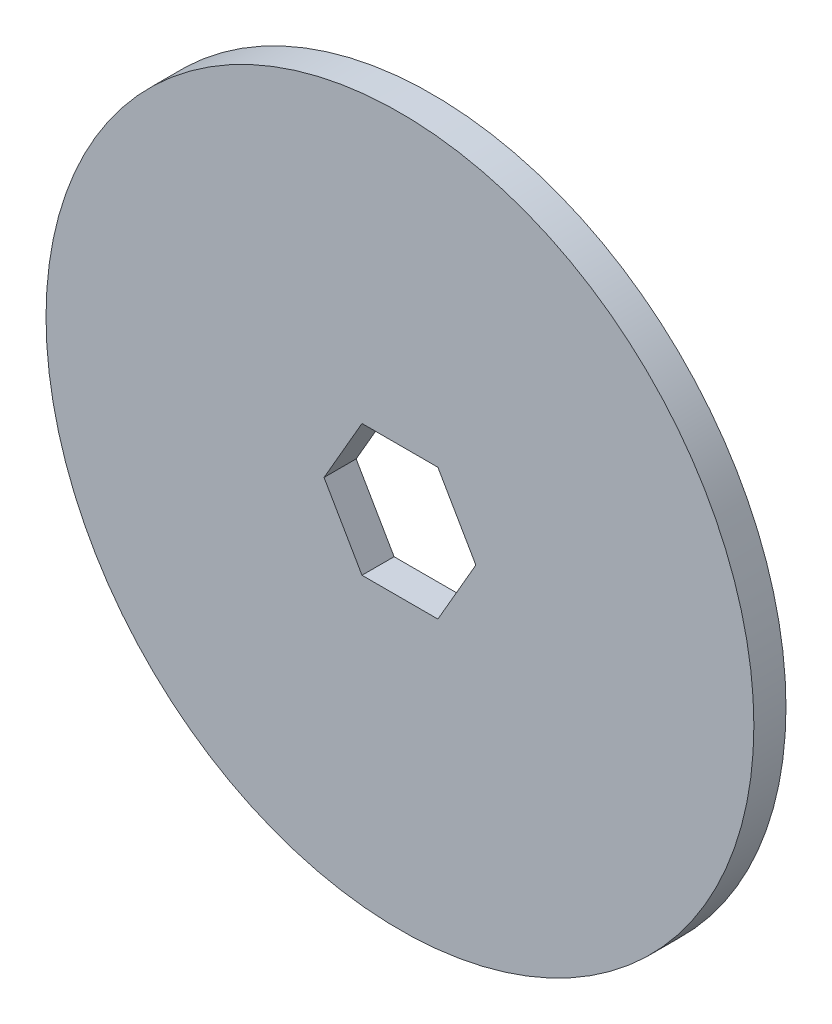
ISO-10303-21;
HEADER;
FILE_DESCRIPTION(('STEP AP214'),'2;1');
FILE_NAME('part.step','',(''),(''),'','','');
FILE_SCHEMA(('AUTOMOTIVE_DESIGN { 1 0 10303 214 1 1 1 1 }'));
ENDSEC;
DATA;
#1=APPLICATION_CONTEXT('core data for automotive mechanical design processes');
#2=APPLICATION_PROTOCOL_DEFINITION('international standard','automotive_design',2000,#1);
#3=PRODUCT_CONTEXT('',#1,'mechanical');
#4=PRODUCT('Part','Part','',(#3));
#5=PRODUCT_RELATED_PRODUCT_CATEGORY('part','',(#4));
#6=PRODUCT_DEFINITION_FORMATION('','',#4);
#7=PRODUCT_DEFINITION_CONTEXT('part definition',#1,'design');
#8=PRODUCT_DEFINITION('design','',#6,#7);
#9=PRODUCT_DEFINITION_SHAPE('','',#8);
#10=(LENGTH_UNIT() NAMED_UNIT(*) SI_UNIT(.MILLI.,.METRE.));
#11=(NAMED_UNIT(*) PLANE_ANGLE_UNIT() SI_UNIT($,.RADIAN.));
#12=(NAMED_UNIT(*) SI_UNIT($,.STERADIAN.) SOLID_ANGLE_UNIT());
#13=UNCERTAINTY_MEASURE_WITH_UNIT(LENGTH_MEASURE(1.E-05),#10,'distance_accuracy_value','');
#14=(GEOMETRIC_REPRESENTATION_CONTEXT(3) GLOBAL_UNCERTAINTY_ASSIGNED_CONTEXT((#13)) GLOBAL_UNIT_ASSIGNED_CONTEXT((#10,
#11,#12)) REPRESENTATION_CONTEXT('',''));
#15=CARTESIAN_POINT('',(0.,0.,0.));
#16=DIRECTION('',(0.,0.,1.));
#17=DIRECTION('',(1.,0.,0.));
#18=AXIS2_PLACEMENT_3D('',#15,#16,#17);
#19=CARTESIAN_POINT('',(0.,0.,3.175));
#20=DIRECTION('',(0.,0.,-1.));
#21=DIRECTION('',(-1.,0.,0.));
#22=AXIS2_PLACEMENT_3D('',#19,#20,#21);
#23=CYLINDRICAL_SURFACE('',#22,35.);
#24=CARTESIAN_POINT('',(0.,0.,3.175));
#25=DIRECTION('',(0.,0.,1.));
#26=DIRECTION('',(1.,0.,0.));
#27=AXIS2_PLACEMENT_3D('',#24,#25,#26);
#28=CIRCLE('',#27,35.);
#29=CARTESIAN_POINT('',(35.,0.,3.175));
#30=VERTEX_POINT('',#29);
#31=EDGE_CURVE('E11',#30,#30,#28,.T.);
#32=ORIENTED_EDGE('',*,*,#31,.F.);
#33=EDGE_LOOP('',(#32));
#34=FACE_BOUND('',#33,.T.);
#35=CARTESIAN_POINT('',(0.,0.,0.));
#36=DIRECTION('',(0.,0.,1.));
#37=DIRECTION('',(1.,0.,0.));
#38=AXIS2_PLACEMENT_3D('',#35,#36,#37);
#39=CIRCLE('',#38,35.);
#40=CARTESIAN_POINT('',(35.,0.,0.));
#41=VERTEX_POINT('',#40);
#42=EDGE_CURVE('E42',#41,#41,#39,.T.);
#43=ORIENTED_EDGE('',*,*,#42,.T.);
#44=EDGE_LOOP('',(#43));
#45=FACE_BOUND('',#44,.T.);
#46=ADVANCED_FACE('F39',(#34,#45),#23,.T.);
#47=CARTESIAN_POINT('',(0.,0.,3.175));
#48=DIRECTION('',(0.,0.,1.));
#49=DIRECTION('',(1.,0.,0.));
#50=AXIS2_PLACEMENT_3D('',#47,#48,#49);
#51=PLANE('',#50);
#52=DIRECTION('',(0.5,0.866025403784439,0.));
#53=VECTOR('',#52,1.);
#54=CARTESIAN_POINT('',(3.75277674973257,-6.5,3.175));
#55=LINE('',#54,#53);
#56=CARTESIAN_POINT('',(3.75277674973257,-6.5,3.175));
#57=VERTEX_POINT('',#56);
#58=CARTESIAN_POINT('',(7.50555349946513,0.,3.175));
#59=VERTEX_POINT('',#58);
#60=EDGE_CURVE('E53',#57,#59,#55,.T.);
#61=ORIENTED_EDGE('',*,*,#60,.F.);
#62=DIRECTION('',(1.,0.,0.));
#63=VECTOR('',#62,1.);
#64=CARTESIAN_POINT('',(-3.75277674973257,-6.5,3.175));
#65=LINE('',#64,#63);
#66=CARTESIAN_POINT('',(-3.75277674973257,-6.5,3.175));
#67=VERTEX_POINT('',#66);
#68=EDGE_CURVE('E99',#67,#57,#65,.T.);
#69=ORIENTED_EDGE('',*,*,#68,.F.);
#70=DIRECTION('',(0.5,-0.866025403784439,0.));
#71=VECTOR('',#70,1.);
#72=CARTESIAN_POINT('',(-7.50555349946514,0.,3.175));
#73=LINE('',#72,#71);
#74=CARTESIAN_POINT('',(-7.50555349946514,0.,3.175));
#75=VERTEX_POINT('',#74);
#76=EDGE_CURVE('E126',#75,#67,#73,.T.);
#77=ORIENTED_EDGE('',*,*,#76,.F.);
#78=DIRECTION('',(-0.5,-0.866025403784439,0.));
#79=VECTOR('',#78,1.);
#80=CARTESIAN_POINT('',(-3.75277674973257,6.5,3.175));
#81=LINE('',#80,#79);
#82=CARTESIAN_POINT('',(-3.75277674973257,6.5,3.175));
#83=VERTEX_POINT('',#82);
#84=EDGE_CURVE('E123',#83,#75,#81,.T.);
#85=ORIENTED_EDGE('',*,*,#84,.F.);
#86=DIRECTION('',(-1.,0.,0.));
#87=VECTOR('',#86,1.);
#88=CARTESIAN_POINT('',(3.75277674973257,6.5,3.175));
#89=LINE('',#88,#87);
#90=CARTESIAN_POINT('',(3.75277674973257,6.5,3.175));
#91=VERTEX_POINT('',#90);
#92=EDGE_CURVE('E120',#91,#83,#89,.T.);
#93=ORIENTED_EDGE('',*,*,#92,.F.);
#94=DIRECTION('',(-0.5,0.866025403784439,0.));
#95=VECTOR('',#94,1.);
#96=CARTESIAN_POINT('',(7.50555349946513,0.,3.175));
#97=LINE('',#96,#95);
#98=EDGE_CURVE('E113',#59,#91,#97,.T.);
#99=ORIENTED_EDGE('',*,*,#98,.F.);
#100=EDGE_LOOP('',(#61,#69,#77,#85,#93,#99));
#101=FACE_BOUND('',#100,.T.);
#102=ORIENTED_EDGE('',*,*,#31,.T.);
#103=EDGE_LOOP('',(#102));
#104=FACE_BOUND('',#103,.T.);
#105=ADVANCED_FACE('F142',(#101,#104),#51,.T.);
#106=CARTESIAN_POINT('',(0.,0.,0.));
#107=DIRECTION('',(0.,0.,1.));
#108=DIRECTION('',(1.,0.,0.));
#109=AXIS2_PLACEMENT_3D('',#106,#107,#108);
#110=PLANE('',#109);
#111=DIRECTION('',(-1.,0.,0.));
#112=VECTOR('',#111,1.);
#113=CARTESIAN_POINT('',(-3.75277674973257,-6.5,0.));
#114=LINE('',#113,#112);
#115=CARTESIAN_POINT('',(3.75277674973257,-6.5,0.));
#116=VERTEX_POINT('',#115);
#117=CARTESIAN_POINT('',(-3.75277674973257,-6.5,0.));
#118=VERTEX_POINT('',#117);
#119=EDGE_CURVE('E111',#116,#118,#114,.T.);
#120=ORIENTED_EDGE('',*,*,#119,.F.);
#121=DIRECTION('',(-0.5,-0.866025403784439,0.));
#122=VECTOR('',#121,1.);
#123=CARTESIAN_POINT('',(3.75277674973257,-6.5,0.));
#124=LINE('',#123,#122);
#125=CARTESIAN_POINT('',(7.50555349946513,0.,0.));
#126=VERTEX_POINT('',#125);
#127=EDGE_CURVE('E93',#126,#116,#124,.T.);
#128=ORIENTED_EDGE('',*,*,#127,.F.);
#129=DIRECTION('',(0.5,-0.866025403784439,0.));
#130=VECTOR('',#129,1.);
#131=CARTESIAN_POINT('',(7.50555349946513,0.,0.));
#132=LINE('',#131,#130);
#133=CARTESIAN_POINT('',(3.75277674973257,6.5,0.));
#134=VERTEX_POINT('',#133);
#135=EDGE_CURVE('E102',#134,#126,#132,.T.);
#136=ORIENTED_EDGE('',*,*,#135,.F.);
#137=DIRECTION('',(1.,0.,0.));
#138=VECTOR('',#137,1.);
#139=CARTESIAN_POINT('',(3.75277674973257,6.5,0.));
#140=LINE('',#139,#138);
#141=CARTESIAN_POINT('',(-3.75277674973257,6.5,0.));
#142=VERTEX_POINT('',#141);
#143=EDGE_CURVE('E61',#142,#134,#140,.T.);
#144=ORIENTED_EDGE('',*,*,#143,.F.);
#145=DIRECTION('',(0.5,0.866025403784439,0.));
#146=VECTOR('',#145,1.);
#147=CARTESIAN_POINT('',(-3.75277674973257,6.5,0.));
#148=LINE('',#147,#146);
#149=CARTESIAN_POINT('',(-7.50555349946514,0.,0.));
#150=VERTEX_POINT('',#149);
#151=EDGE_CURVE('E151',#150,#142,#148,.T.);
#152=ORIENTED_EDGE('',*,*,#151,.F.);
#153=DIRECTION('',(-0.5,0.866025403784439,0.));
#154=VECTOR('',#153,1.);
#155=CARTESIAN_POINT('',(-7.50555349946514,0.,0.));
#156=LINE('',#155,#154);
#157=EDGE_CURVE('E115',#118,#150,#156,.T.);
#158=ORIENTED_EDGE('',*,*,#157,.F.);
#159=EDGE_LOOP('',(#120,#128,#136,#144,#152,#158));
#160=FACE_BOUND('',#159,.T.);
#161=ORIENTED_EDGE('',*,*,#42,.F.);
#162=EDGE_LOOP('',(#161));
#163=FACE_BOUND('',#162,.T.);
#164=ADVANCED_FACE('F107',(#160,#163),#110,.F.);
#165=CARTESIAN_POINT('',(3.75277674973257,-6.5,-0.00100000000000013));
#166=DIRECTION('',(0.866025403784439,-0.5,0.));
#167=DIRECTION('',(0.5,0.866025403784439,0.));
#168=AXIS2_PLACEMENT_3D('',#165,#166,#167);
#169=PLANE('',#168);
#170=ORIENTED_EDGE('',*,*,#127,.T.);
#171=DIRECTION('',(0.,0.,1.));
#172=VECTOR('',#171,1.);
#173=CARTESIAN_POINT('',(3.75277674973257,-6.5,-0.00100000000000013));
#174=LINE('',#173,#172);
#175=EDGE_CURVE('E105',#116,#57,#174,.T.);
#176=ORIENTED_EDGE('',*,*,#175,.T.);
#177=ORIENTED_EDGE('',*,*,#60,.T.);
#178=DIRECTION('',(0.,0.,1.));
#179=VECTOR('',#178,1.);
#180=CARTESIAN_POINT('',(7.50555349946513,0.,-0.00100000000000013));
#181=LINE('',#180,#179);
#182=EDGE_CURVE('E89',#126,#59,#181,.T.);
#183=ORIENTED_EDGE('',*,*,#182,.F.);
#184=EDGE_LOOP('',(#170,#176,#177,#183));
#185=FACE_BOUND('',#184,.T.);
#186=ADVANCED_FACE('F91',(#185),#169,.F.);
#187=CARTESIAN_POINT('',(-3.75277674973257,-6.5,-0.00100000000000013));
#188=DIRECTION('',(0.,-1.,0.));
#189=DIRECTION('',(1.,0.,0.));
#190=AXIS2_PLACEMENT_3D('',#187,#188,#189);
#191=PLANE('',#190);
#192=ORIENTED_EDGE('',*,*,#119,.T.);
#193=DIRECTION('',(0.,0.,1.));
#194=VECTOR('',#193,1.);
#195=CARTESIAN_POINT('',(-3.75277674973257,-6.5,-0.00100000000000013));
#196=LINE('',#195,#194);
#197=EDGE_CURVE('E132',#118,#67,#196,.T.);
#198=ORIENTED_EDGE('',*,*,#197,.T.);
#199=ORIENTED_EDGE('',*,*,#68,.T.);
#200=ORIENTED_EDGE('',*,*,#175,.F.);
#201=EDGE_LOOP('',(#192,#198,#199,#200));
#202=FACE_BOUND('',#201,.T.);
#203=ADVANCED_FACE('F157',(#202),#191,.F.);
#204=CARTESIAN_POINT('',(-7.50555349946514,0.,-0.00100000000000013));
#205=DIRECTION('',(-0.866025403784439,-0.5,0.));
#206=DIRECTION('',(0.5,-0.866025403784439,0.));
#207=AXIS2_PLACEMENT_3D('',#204,#205,#206);
#208=PLANE('',#207);
#209=ORIENTED_EDGE('',*,*,#157,.T.);
#210=DIRECTION('',(0.,0.,1.));
#211=VECTOR('',#210,1.);
#212=CARTESIAN_POINT('',(-7.50555349946514,0.,-0.00100000000000013));
#213=LINE('',#212,#211);
#214=EDGE_CURVE('E134',#150,#75,#213,.T.);
#215=ORIENTED_EDGE('',*,*,#214,.T.);
#216=ORIENTED_EDGE('',*,*,#76,.T.);
#217=ORIENTED_EDGE('',*,*,#197,.F.);
#218=EDGE_LOOP('',(#209,#215,#216,#217));
#219=FACE_BOUND('',#218,.T.);
#220=ADVANCED_FACE('F155',(#219),#208,.F.);
#221=CARTESIAN_POINT('',(-3.75277674973257,6.5,-0.00100000000000013));
#222=DIRECTION('',(-0.866025403784439,0.5,0.));
#223=DIRECTION('',(-0.5,-0.866025403784439,0.));
#224=AXIS2_PLACEMENT_3D('',#221,#222,#223);
#225=PLANE('',#224);
#226=ORIENTED_EDGE('',*,*,#151,.T.);
#227=DIRECTION('',(0.,0.,1.));
#228=VECTOR('',#227,1.);
#229=CARTESIAN_POINT('',(-3.75277674973257,6.5,-0.00100000000000013));
#230=LINE('',#229,#228);
#231=EDGE_CURVE('E136',#142,#83,#230,.T.);
#232=ORIENTED_EDGE('',*,*,#231,.T.);
#233=ORIENTED_EDGE('',*,*,#84,.T.);
#234=ORIENTED_EDGE('',*,*,#214,.F.);
#235=EDGE_LOOP('',(#226,#232,#233,#234));
#236=FACE_BOUND('',#235,.T.);
#237=ADVANCED_FACE('F148',(#236),#225,.F.);
#238=CARTESIAN_POINT('',(3.75277674973257,6.5,-0.00100000000000013));
#239=DIRECTION('',(0.,1.,0.));
#240=DIRECTION('',(-1.,0.,0.));
#241=AXIS2_PLACEMENT_3D('',#238,#239,#240);
#242=PLANE('',#241);
#243=ORIENTED_EDGE('',*,*,#143,.T.);
#244=DIRECTION('',(0.,0.,1.));
#245=VECTOR('',#244,1.);
#246=CARTESIAN_POINT('',(3.75277674973257,6.5,-0.00100000000000013));
#247=LINE('',#246,#245);
#248=EDGE_CURVE('E98',#134,#91,#247,.T.);
#249=ORIENTED_EDGE('',*,*,#248,.T.);
#250=ORIENTED_EDGE('',*,*,#92,.T.);
#251=ORIENTED_EDGE('',*,*,#231,.F.);
#252=EDGE_LOOP('',(#243,#249,#250,#251));
#253=FACE_BOUND('',#252,.T.);
#254=ADVANCED_FACE('F138',(#253),#242,.F.);
#255=CARTESIAN_POINT('',(7.50555349946513,0.,-0.00100000000000013));
#256=DIRECTION('',(0.866025403784439,0.5,0.));
#257=DIRECTION('',(-0.5,0.866025403784439,0.));
#258=AXIS2_PLACEMENT_3D('',#255,#256,#257);
#259=PLANE('',#258);
#260=ORIENTED_EDGE('',*,*,#135,.T.);
#261=ORIENTED_EDGE('',*,*,#182,.T.);
#262=ORIENTED_EDGE('',*,*,#98,.T.);
#263=ORIENTED_EDGE('',*,*,#248,.F.);
#264=EDGE_LOOP('',(#260,#261,#262,#263));
#265=FACE_BOUND('',#264,.T.);
#266=ADVANCED_FACE('F103',(#265),#259,.F.);
#267=CLOSED_SHELL('',(#46,#105,#164,#186,#203,#220,#237,#254,#266));
#268=MANIFOLD_SOLID_BREP('B2',#267);
#269=ADVANCED_BREP_SHAPE_REPRESENTATION('',(#18,#268),#14);
#270=SHAPE_DEFINITION_REPRESENTATION(#9,#269);
ENDSEC;
END-ISO-10303-21;
